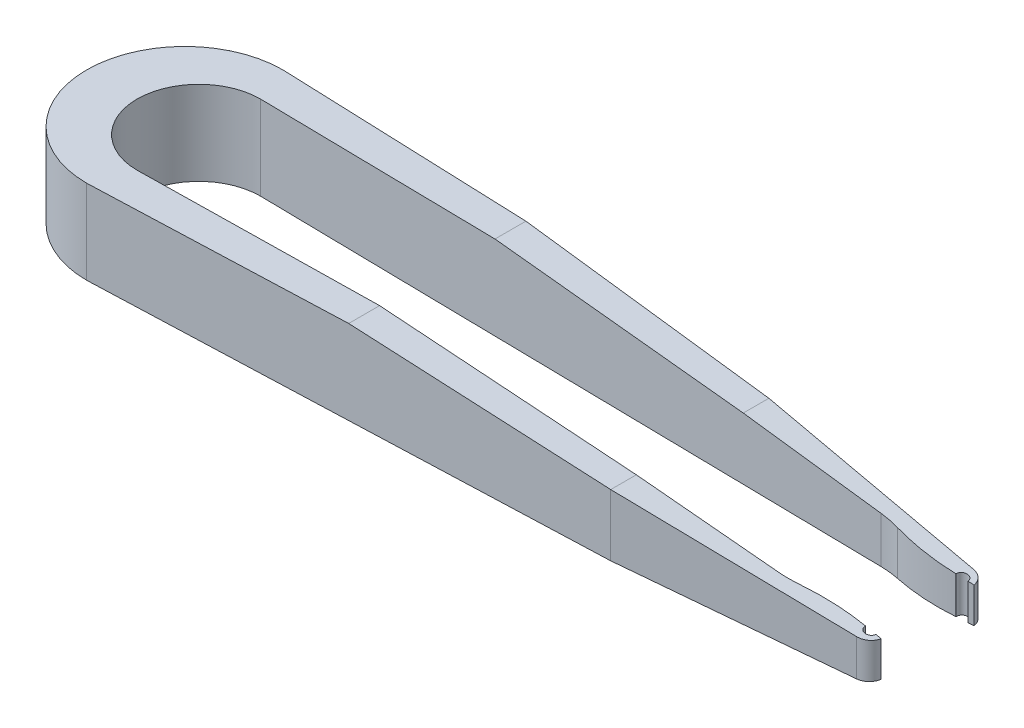
ISO-10303-21;
HEADER;
FILE_DESCRIPTION(('STEP AP214'),'2;1');
FILE_NAME('part.step','',(''),(''),'','','');
FILE_SCHEMA(('AUTOMOTIVE_DESIGN { 1 0 10303 214 1 1 1 1 }'));
ENDSEC;
DATA;
#1=APPLICATION_CONTEXT('core data for automotive mechanical design processes');
#2=APPLICATION_PROTOCOL_DEFINITION('international standard','automotive_design',2000,#1);
#3=PRODUCT_CONTEXT('',#1,'mechanical');
#4=PRODUCT('Part','Part','',(#3));
#5=PRODUCT_RELATED_PRODUCT_CATEGORY('part','',(#4));
#6=PRODUCT_DEFINITION_FORMATION('','',#4);
#7=PRODUCT_DEFINITION_CONTEXT('part definition',#1,'design');
#8=PRODUCT_DEFINITION('design','',#6,#7);
#9=PRODUCT_DEFINITION_SHAPE('','',#8);
#10=(LENGTH_UNIT() NAMED_UNIT(*) SI_UNIT(.MILLI.,.METRE.));
#11=(NAMED_UNIT(*) PLANE_ANGLE_UNIT() SI_UNIT($,.RADIAN.));
#12=(NAMED_UNIT(*) SI_UNIT($,.STERADIAN.) SOLID_ANGLE_UNIT());
#13=UNCERTAINTY_MEASURE_WITH_UNIT(LENGTH_MEASURE(1.E-05),#10,'distance_accuracy_value','');
#14=(GEOMETRIC_REPRESENTATION_CONTEXT(3) GLOBAL_UNCERTAINTY_ASSIGNED_CONTEXT((#13)) GLOBAL_UNIT_ASSIGNED_CONTEXT((#10,
#11,#12)) REPRESENTATION_CONTEXT('',''));
#15=CARTESIAN_POINT('',(0.,0.,0.));
#16=DIRECTION('',(0.,0.,1.));
#17=DIRECTION('',(1.,0.,0.));
#18=AXIS2_PLACEMENT_3D('',#15,#16,#17);
#19=CARTESIAN_POINT('',(32.8354405717214,0.,3.81));
#20=DIRECTION('',(0.0759013080870932,0.,-0.997115335069453));
#21=DIRECTION('',(-0.997115335069453,0.,-0.0759013080870932));
#22=AXIS2_PLACEMENT_3D('',#19,#20,#21);
#23=PLANE('',#22);
#24=DIRECTION('',(-0.997115335069453,0.,-0.0759013080870932));
#25=VECTOR('',#24,1.);
#26=CARTESIAN_POINT('',(32.8354405717214,0.,3.81));
#27=LINE('',#26,#25);
#28=CARTESIAN_POINT('',(36.5641527941834,0.,4.09383289797211));
#29=VERTEX_POINT('',#28);
#30=CARTESIAN_POINT('',(36.5332647207182,0.,4.09148167028777));
#31=VERTEX_POINT('',#30);
#32=EDGE_CURVE('E359',#29,#31,#27,.T.);
#33=ORIENTED_EDGE('',*,*,#32,.T.);
#34=DIRECTION('',(0.,1.,0.));
#35=VECTOR('',#34,1.);
#36=CARTESIAN_POINT('',(36.5332647207182,3.77956014151456,4.09148167028777));
#37=LINE('',#36,#35);
#38=CARTESIAN_POINT('',(36.5332647207182,3.36753841599143,4.09148167028777));
#39=VERTEX_POINT('',#38);
#40=EDGE_CURVE('E319',#31,#39,#37,.T.);
#41=ORIENTED_EDGE('',*,*,#40,.T.);
#42=DIRECTION('',(-0.991017776971419,0.110421923282272,-0.075437156529595));
#43=VECTOR('',#42,1.);
#44=CARTESIAN_POINT('',(33.2490381741618,3.73347596039525,3.84148341815917));
#45=LINE('',#44,#43);
#46=CARTESIAN_POINT('',(36.5641527941834,3.36409678198872,4.09383289797211));
#47=VERTEX_POINT('',#46);
#48=EDGE_CURVE('E439',#47,#39,#45,.T.);
#49=ORIENTED_EDGE('',*,*,#48,.F.);
#50=DIRECTION('',(0.,1.,0.));
#51=VECTOR('',#50,1.);
#52=CARTESIAN_POINT('',(36.5641527941834,0.,4.09383289797211));
#53=LINE('',#52,#51);
#54=EDGE_CURVE('E312',#47,#29,#53,.F.);
#55=ORIENTED_EDGE('',*,*,#54,.T.);
#56=EDGE_LOOP('',(#33,#41,#49,#55));
#57=FACE_BOUND('',#56,.T.);
#58=ADVANCED_FACE('F38',(#57),#23,.T.);
#59=DIRECTION('',(-0.991017776971419,0.110421923282272,-0.075437156529595));
#60=VECTOR('',#59,1.);
#61=CARTESIAN_POINT('',(33.2490381741618,3.73347596039525,3.84148341815917));
#62=LINE('',#61,#60);
#63=CARTESIAN_POINT('',(38.0866873843987,3.19445179516604,4.20972958809481));
#64=VERTEX_POINT('',#63);
#65=CARTESIAN_POINT('',(37.577221974614,3.25121783075235,4.1709486269886));
#66=VERTEX_POINT('',#65);
#67=EDGE_CURVE('E390',#64,#66,#62,.T.);
#68=ORIENTED_EDGE('',*,*,#67,.F.);
#69=DIRECTION('',(0.,1.,0.));
#70=VECTOR('',#69,1.);
#71=CARTESIAN_POINT('',(38.0866873843987,0.,4.20972958809486));
#72=LINE('',#71,#70);
#73=CARTESIAN_POINT('',(38.0866873843987,0.,4.20972958809486));
#74=VERTEX_POINT('',#73);
#75=EDGE_CURVE('E362',#74,#64,#72,.T.);
#76=ORIENTED_EDGE('',*,*,#75,.F.);
#77=CARTESIAN_POINT('',(37.577221974614,0.,4.1709486269886));
#78=VERTEX_POINT('',#77);
#79=EDGE_CURVE('E360',#74,#78,#27,.T.);
#80=ORIENTED_EDGE('',*,*,#79,.T.);
#81=DIRECTION('',(0.,1.,0.));
#82=VECTOR('',#81,1.);
#83=CARTESIAN_POINT('',(37.577221974614,0.,4.1709486269886));
#84=LINE('',#83,#82);
#85=EDGE_CURVE('E309',#78,#66,#84,.T.);
#86=ORIENTED_EDGE('',*,*,#85,.T.);
#87=EDGE_LOOP('',(#68,#76,#80,#86));
#88=FACE_BOUND('',#87,.T.);
#89=ADVANCED_FACE('F473',(#88),#23,.T.);
#90=CARTESIAN_POINT('',(32.8354405717214,0.,-3.81));
#91=DIRECTION('',(-0.0759013080870932,0.,-0.997115335069453));
#92=DIRECTION('',(-0.997115335069453,0.,0.0759013080870932));
#93=AXIS2_PLACEMENT_3D('',#90,#91,#92);
#94=PLANE('',#93);
#95=DIRECTION('',(-0.991017776971419,0.110421923282272,0.075437156529595));
#96=VECTOR('',#95,1.);
#97=CARTESIAN_POINT('',(33.2490381741618,3.73347596039525,-3.84148341815917));
#98=LINE('',#97,#96);
#99=CARTESIAN_POINT('',(36.5641527941834,3.36409678198872,-4.09383289797211));
#100=VERTEX_POINT('',#99);
#101=CARTESIAN_POINT('',(36.5332647207182,3.36753841599143,-4.09148167028777));
#102=VERTEX_POINT('',#101);
#103=EDGE_CURVE('E341',#100,#102,#98,.T.);
#104=ORIENTED_EDGE('',*,*,#103,.T.);
#105=DIRECTION('',(0.,-1.,0.));
#106=VECTOR('',#105,1.);
#107=CARTESIAN_POINT('',(36.5332647207182,0.,-4.09148167028777));
#108=LINE('',#107,#106);
#109=CARTESIAN_POINT('',(36.5332647207182,0.,-4.09148167028777));
#110=VERTEX_POINT('',#109);
#111=EDGE_CURVE('E11',#102,#110,#108,.T.);
#112=ORIENTED_EDGE('',*,*,#111,.T.);
#113=DIRECTION('',(-0.997115335069453,0.,0.0759013080870932));
#114=VECTOR('',#113,1.);
#115=CARTESIAN_POINT('',(32.8354405717214,0.,-3.81));
#116=LINE('',#115,#114);
#117=CARTESIAN_POINT('',(36.5641527941834,0.,-4.09383289797211));
#118=VERTEX_POINT('',#117);
#119=EDGE_CURVE('E224',#118,#110,#116,.T.);
#120=ORIENTED_EDGE('',*,*,#119,.F.);
#121=DIRECTION('',(0.,1.,0.));
#122=VECTOR('',#121,1.);
#123=CARTESIAN_POINT('',(36.5641527941834,0.,-4.09383289797211));
#124=LINE('',#123,#122);
#125=EDGE_CURVE('E306',#118,#100,#124,.T.);
#126=ORIENTED_EDGE('',*,*,#125,.T.);
#127=EDGE_LOOP('',(#104,#112,#120,#126));
#128=FACE_BOUND('',#127,.T.);
#129=ADVANCED_FACE('F373',(#128),#94,.F.);
#130=CARTESIAN_POINT('',(0.,7.62,0.));
#131=DIRECTION('',(0.,-1.,0.));
#132=DIRECTION('',(0.,0.,-1.));
#133=AXIS2_PLACEMENT_3D('',#130,#131,#132);
#134=PLANE('',#133);
#135=DIRECTION('',(0.999288762356679,0.,-0.037709009900252));
#136=VECTOR('',#135,1.);
#137=CARTESIAN_POINT('',(-29.21,7.62,8.89));
#138=LINE('',#137,#136);
#139=CARTESIAN_POINT('',(-29.21,7.62,8.89));
#140=VERTEX_POINT('',#139);
#141=CARTESIAN_POINT('',(-6.3333197793544,7.62,8.02672904827752));
#142=VERTEX_POINT('',#141);
#143=EDGE_CURVE('E236',#140,#142,#138,.T.);
#144=ORIENTED_EDGE('',*,*,#143,.T.);
#145=DIRECTION('',(0.,0.,1.));
#146=VECTOR('',#145,1.);
#147=CARTESIAN_POINT('',(-6.3333197793544,7.62,-8.89));
#148=LINE('',#147,#146);
#149=CARTESIAN_POINT('',(-6.3333197793544,7.62,5.22679509720263));
#150=VERTEX_POINT('',#149);
#151=EDGE_CURVE('E411',#150,#142,#148,.T.);
#152=ORIENTED_EDGE('',*,*,#151,.F.);
#153=DIRECTION('',(-0.999860295571869,0.,0.016714943581564));
#154=VECTOR('',#153,1.);
#155=CARTESIAN_POINT('',(0.085583917776607,7.62,5.1194884928418));
#156=LINE('',#155,#154);
#157=CARTESIAN_POINT('',(-27.94,7.62,5.588));
#158=VERTEX_POINT('',#157);
#159=EDGE_CURVE('E261',#150,#158,#156,.T.);
#160=ORIENTED_EDGE('',*,*,#159,.T.);
#161=CARTESIAN_POINT('',(-27.94,7.62,0.));
#162=DIRECTION('',(0.,1.,0.));
#163=DIRECTION('',(0.,0.,1.));
#164=AXIS2_PLACEMENT_3D('',#161,#162,#163);
#165=CIRCLE('',#164,5.588);
#166=CARTESIAN_POINT('',(-27.94,7.62,-5.588));
#167=VERTEX_POINT('',#166);
#168=EDGE_CURVE('E246',#167,#158,#165,.T.);
#169=ORIENTED_EDGE('',*,*,#168,.F.);
#170=DIRECTION('',(0.999860295571869,0.,0.016714943581564));
#171=VECTOR('',#170,1.);
#172=CARTESIAN_POINT('',(0.085583917776607,7.62,-5.1194884928418));
#173=LINE('',#172,#171);
#174=CARTESIAN_POINT('',(-6.3333197793544,7.62,-5.22679509720263));
#175=VERTEX_POINT('',#174);
#176=EDGE_CURVE('E253',#167,#175,#173,.T.);
#177=ORIENTED_EDGE('',*,*,#176,.T.);
#178=CARTESIAN_POINT('',(-6.3333197793544,7.62,-8.02672904827752));
#179=VERTEX_POINT('',#178);
#180=EDGE_CURVE('E401',#179,#175,#148,.T.);
#181=ORIENTED_EDGE('',*,*,#180,.F.);
#182=DIRECTION('',(0.999288762356679,0.,0.037709009900252));
#183=VECTOR('',#182,1.);
#184=CARTESIAN_POINT('',(-29.21,7.62,-8.89));
#185=LINE('',#184,#183);
#186=CARTESIAN_POINT('',(-29.21,7.62,-8.89));
#187=VERTEX_POINT('',#186);
#188=EDGE_CURVE('E240',#187,#179,#185,.T.);
#189=ORIENTED_EDGE('',*,*,#188,.F.);
#190=CARTESIAN_POINT('',(-29.21,7.62,0.));
#191=DIRECTION('',(0.,-1.,0.));
#192=DIRECTION('',(0.,0.,-1.));
#193=AXIS2_PLACEMENT_3D('',#190,#191,#192);
#194=CIRCLE('',#193,8.89);
#195=CARTESIAN_POINT('',(-38.1,7.62,0.));
#196=VERTEX_POINT('',#195);
#197=EDGE_CURVE('E280',#187,#196,#194,.F.);
#198=ORIENTED_EDGE('',*,*,#197,.T.);
#199=CARTESIAN_POINT('',(-29.21,7.62,0.));
#200=DIRECTION('',(0.,-1.,0.));
#201=DIRECTION('',(0.,0.,-1.));
#202=AXIS2_PLACEMENT_3D('',#199,#200,#201);
#203=CIRCLE('',#202,8.89);
#204=EDGE_CURVE('E277',#196,#140,#203,.F.);
#205=ORIENTED_EDGE('',*,*,#204,.T.);
#206=EDGE_LOOP('',(#144,#152,#160,#169,#177,#181,#189,#198,#205));
#207=FACE_BOUND('',#206,.T.);
#208=ADVANCED_FACE('F399',(#207),#134,.F.);
#209=CARTESIAN_POINT('',(0.,0.,0.));
#210=DIRECTION('',(0.,-1.,0.));
#211=DIRECTION('',(0.,0.,-1.));
#212=AXIS2_PLACEMENT_3D('',#209,#210,#211);
#213=PLANE('',#212);
#214=CARTESIAN_POINT('',(29.0992515650635,0.,-4.25678323165612));
#215=DIRECTION('',(0.,-1.,0.));
#216=DIRECTION('',(0.,0.,-1.));
#217=AXIS2_PLACEMENT_3D('',#214,#215,#216);
#218=CIRCLE('',#217,8.89);
#219=CARTESIAN_POINT('',(29.2478474135036,0.,4.63197479597779));
#220=VERTEX_POINT('',#219);
#221=CARTESIAN_POINT('',(30.8923772184232,0.,4.45050109764328));
#222=VERTEX_POINT('',#221);
#223=EDGE_CURVE('E291',#220,#222,#218,.F.);
#224=ORIENTED_EDGE('',*,*,#223,.T.);
#225=CARTESIAN_POINT('',(34.9909501403885,0.,24.3528652788991));
#226=DIRECTION('',(0.,-1.,0.));
#227=DIRECTION('',(0.,0.,-1.));
#228=AXIS2_PLACEMENT_3D('',#225,#226,#227);
#229=CIRCLE('',#228,20.32);
#230=EDGE_CURVE('E328',#222,#31,#229,.T.);
#231=ORIENTED_EDGE('',*,*,#230,.T.);
#232=ORIENTED_EDGE('',*,*,#32,.F.);
#233=CARTESIAN_POINT('',(37.0706873843987,0.,4.13239076248036));
#234=DIRECTION('',(0.,-1.,0.));
#235=DIRECTION('',(0.,0.,-1.));
#236=AXIS2_PLACEMENT_3D('',#233,#234,#235);
#237=CIRCLE('',#236,0.508000000000002);
#238=EDGE_CURVE('E353',#78,#29,#237,.T.);
#239=ORIENTED_EDGE('',*,*,#238,.F.);
#240=ORIENTED_EDGE('',*,*,#79,.F.);
#241=CARTESIAN_POINT('',(36.83,0.,4.02632615875612));
#242=DIRECTION('',(0.,-1.,0.));
#243=DIRECTION('',(0.,0.,-1.));
#244=AXIS2_PLACEMENT_3D('',#241,#242,#243);
#245=CIRCLE('',#244,1.27);
#246=CARTESIAN_POINT('',(36.9460657696457,0.,5.29101139118218));
#247=VERTEX_POINT('',#246);
#248=EDGE_CURVE('E301',#74,#247,#245,.T.);
#249=ORIENTED_EDGE('',*,*,#248,.T.);
#250=DIRECTION('',(0.995815143642565,0.,-0.091390369799764));
#251=VECTOR('',#250,1.);
#252=CARTESIAN_POINT('',(16.5433604412912,0.,7.16345809655505));
#253=LINE('',#252,#251);
#254=CARTESIAN_POINT('',(16.5433604412912,0.,7.16345809655505));
#255=VERTEX_POINT('',#254);
#256=EDGE_CURVE('E219',#255,#247,#253,.T.);
#257=ORIENTED_EDGE('',*,*,#256,.F.);
#258=DIRECTION('',(0.999288762356679,0.,-0.037709009900252));
#259=VECTOR('',#258,1.);
#260=CARTESIAN_POINT('',(-29.21,0.,8.89));
#261=LINE('',#260,#259);
#262=CARTESIAN_POINT('',(-29.21,0.,8.89));
#263=VERTEX_POINT('',#262);
#264=EDGE_CURVE('E237',#263,#255,#261,.T.);
#265=ORIENTED_EDGE('',*,*,#264,.F.);
#266=CARTESIAN_POINT('',(-29.21,0.,0.));
#267=DIRECTION('',(0.,-1.,0.));
#268=DIRECTION('',(0.,0.,-1.));
#269=AXIS2_PLACEMENT_3D('',#266,#267,#268);
#270=CIRCLE('',#269,8.89);
#271=CARTESIAN_POINT('',(-38.1,0.,0.));
#272=VERTEX_POINT('',#271);
#273=EDGE_CURVE('E270',#263,#272,#270,.T.);
#274=ORIENTED_EDGE('',*,*,#273,.T.);
#275=CARTESIAN_POINT('',(-29.21,0.,0.));
#276=DIRECTION('',(0.,-1.,0.));
#277=DIRECTION('',(0.,0.,-1.));
#278=AXIS2_PLACEMENT_3D('',#275,#276,#277);
#279=CIRCLE('',#278,8.89);
#280=CARTESIAN_POINT('',(-29.21,0.,-8.89));
#281=VERTEX_POINT('',#280);
#282=EDGE_CURVE('E272',#272,#281,#279,.T.);
#283=ORIENTED_EDGE('',*,*,#282,.T.);
#284=DIRECTION('',(0.999288762356679,0.,0.037709009900252));
#285=VECTOR('',#284,1.);
#286=CARTESIAN_POINT('',(-29.21,0.,-8.89));
#287=LINE('',#286,#285);
#288=CARTESIAN_POINT('',(16.5433604412912,0.,-7.16345809655505));
#289=VERTEX_POINT('',#288);
#290=EDGE_CURVE('E243',#281,#289,#287,.T.);
#291=ORIENTED_EDGE('',*,*,#290,.T.);
#292=DIRECTION('',(0.995815143642565,0.,0.091390369799764));
#293=VECTOR('',#292,1.);
#294=CARTESIAN_POINT('',(16.5433604412912,0.,-7.16345809655505));
#295=LINE('',#294,#293);
#296=CARTESIAN_POINT('',(36.9460657696457,0.,-5.29101139118218));
#297=VERTEX_POINT('',#296);
#298=EDGE_CURVE('E230',#289,#297,#295,.T.);
#299=ORIENTED_EDGE('',*,*,#298,.T.);
#300=CARTESIAN_POINT('',(36.83,0.,-4.02632615875612));
#301=DIRECTION('',(0.,-1.,0.));
#302=DIRECTION('',(0.,0.,-1.));
#303=AXIS2_PLACEMENT_3D('',#300,#301,#302);
#304=CIRCLE('',#303,1.27);
#305=CARTESIAN_POINT('',(38.0866873843987,0.,-4.20972958809486));
#306=VERTEX_POINT('',#305);
#307=EDGE_CURVE('E299',#297,#306,#304,.T.);
#308=ORIENTED_EDGE('',*,*,#307,.T.);
#309=CARTESIAN_POINT('',(37.577221974614,0.,-4.1709486269886));
#310=VERTEX_POINT('',#309);
#311=EDGE_CURVE('E218',#306,#310,#116,.T.);
#312=ORIENTED_EDGE('',*,*,#311,.T.);
#313=CARTESIAN_POINT('',(37.0706873843987,0.,-4.13239076248036));
#314=DIRECTION('',(0.,1.,0.));
#315=DIRECTION('',(0.,0.,1.));
#316=AXIS2_PLACEMENT_3D('',#313,#314,#315);
#317=CIRCLE('',#316,0.508000000000002);
#318=EDGE_CURVE('E356',#310,#118,#317,.T.);
#319=ORIENTED_EDGE('',*,*,#318,.T.);
#320=ORIENTED_EDGE('',*,*,#119,.T.);
#321=CARTESIAN_POINT('',(34.9909501403885,0.,-24.3528652788991));
#322=DIRECTION('',(0.,-1.,0.));
#323=DIRECTION('',(0.,0.,-1.));
#324=AXIS2_PLACEMENT_3D('',#321,#322,#323);
#325=CIRCLE('',#324,20.32);
#326=CARTESIAN_POINT('',(30.8923772184232,0.,-4.45050109764328));
#327=VERTEX_POINT('',#326);
#328=EDGE_CURVE('E326',#110,#327,#325,.T.);
#329=ORIENTED_EDGE('',*,*,#328,.T.);
#330=CARTESIAN_POINT('',(29.0992515650635,0.,4.25678323165612));
#331=DIRECTION('',(0.,-1.,0.));
#332=DIRECTION('',(0.,0.,-1.));
#333=AXIS2_PLACEMENT_3D('',#330,#331,#332);
#334=CIRCLE('',#333,8.89);
#335=CARTESIAN_POINT('',(29.2478474135036,0.,-4.63197479597779));
#336=VERTEX_POINT('',#335);
#337=EDGE_CURVE('E294',#327,#336,#334,.F.);
#338=ORIENTED_EDGE('',*,*,#337,.T.);
#339=DIRECTION('',(0.999860295571869,0.,0.016714943581564));
#340=VECTOR('',#339,1.);
#341=CARTESIAN_POINT('',(0.085583917776607,0.,-5.1194884928418));
#342=LINE('',#341,#340);
#343=CARTESIAN_POINT('',(-27.94,0.,-5.588));
#344=VERTEX_POINT('',#343);
#345=EDGE_CURVE('E255',#344,#336,#342,.T.);
#346=ORIENTED_EDGE('',*,*,#345,.F.);
#347=CARTESIAN_POINT('',(-27.94,0.,0.));
#348=DIRECTION('',(0.,1.,0.));
#349=DIRECTION('',(0.,0.,1.));
#350=AXIS2_PLACEMENT_3D('',#347,#348,#349);
#351=CIRCLE('',#350,5.588);
#352=CARTESIAN_POINT('',(-27.94,0.,5.588));
#353=VERTEX_POINT('',#352);
#354=EDGE_CURVE('E249',#344,#353,#351,.T.);
#355=ORIENTED_EDGE('',*,*,#354,.T.);
#356=DIRECTION('',(-0.999860295571869,0.,0.016714943581564));
#357=VECTOR('',#356,1.);
#358=CARTESIAN_POINT('',(0.085583917776607,0.,5.1194884928418));
#359=LINE('',#358,#357);
#360=EDGE_CURVE('E252',#220,#353,#359,.T.);
#361=ORIENTED_EDGE('',*,*,#360,.F.);
#362=EDGE_LOOP('',(#224,#231,#232,#239,#240,#249,#257,#265,#274,#283,#291,#299,#308,#312,#319,
#320,#329,#338,#346,#355,#361));
#363=FACE_BOUND('',#362,.T.);
#364=ADVANCED_FACE('F370',(#363),#213,.T.);
#365=CARTESIAN_POINT('',(36.83,0.,4.02632615875612));
#366=DIRECTION('',(0.,-1.,0.));
#367=DIRECTION('',(0.,0.,-1.));
#368=AXIS2_PLACEMENT_3D('',#365,#366,#367);
#369=CYLINDRICAL_SURFACE('',#368,1.27);
#370=CARTESIAN_POINT('',(36.83,3.3344753559683,4.02632615875612));
#371=DIRECTION('',(-0.11073746325577,-0.993849693983792,0.));
#372=DIRECTION('',(0.993849693983792,-0.11073746325577,0.));
#373=AXIS2_PLACEMENT_3D('',#370,#371,#372);
#374=ELLIPSE('',#373,1.27785922528111,1.27);
#375=CARTESIAN_POINT('',(36.9460657696457,3.32154298905286,5.29101139118218));
#376=VERTEX_POINT('',#375);
#377=EDGE_CURVE('E378',#376,#64,#374,.F.);
#378=ORIENTED_EDGE('',*,*,#377,.F.);
#379=DIRECTION('',(0.,1.,0.));
#380=VECTOR('',#379,1.);
#381=CARTESIAN_POINT('',(36.9460657696457,7.62,5.29101139118218));
#382=LINE('',#381,#380);
#383=EDGE_CURVE('E296',#247,#376,#382,.T.);
#384=ORIENTED_EDGE('',*,*,#383,.F.);
#385=ORIENTED_EDGE('',*,*,#248,.F.);
#386=ORIENTED_EDGE('',*,*,#75,.T.);
#387=EDGE_LOOP('',(#378,#384,#385,#386));
#388=FACE_BOUND('',#387,.T.);
#389=ADVANCED_FACE('F432',(#388),#369,.T.);
#390=CARTESIAN_POINT('',(-29.21,0.,8.89));
#391=DIRECTION('',(0.037709009900252,0.,0.999288762356679));
#392=DIRECTION('',(0.999288762356679,0.,-0.037709009900252));
#393=AXIS2_PLACEMENT_3D('',#390,#391,#392);
#394=PLANE('',#393);
#395=DIRECTION('',(0.995401680306779,-0.0881167770110264,-0.0375623275587464));
#396=VECTOR('',#395,1.);
#397=CARTESIAN_POINT('',(-28.3640101978275,9.57024126783196,8.85807585652179));
#398=LINE('',#397,#396);
#399=CARTESIAN_POINT('',(16.5433604412912,5.59486846804004,7.16345809655504));
#400=VERTEX_POINT('',#399);
#401=EDGE_CURVE('E351',#142,#400,#398,.T.);
#402=ORIENTED_EDGE('',*,*,#401,.F.);
#403=ORIENTED_EDGE('',*,*,#143,.F.);
#404=DIRECTION('',(0.,-1.,0.));
#405=VECTOR('',#404,1.);
#406=CARTESIAN_POINT('',(-29.21,7.62,8.89));
#407=LINE('',#406,#405);
#408=EDGE_CURVE('E282',#140,#263,#407,.T.);
#409=ORIENTED_EDGE('',*,*,#408,.T.);
#410=ORIENTED_EDGE('',*,*,#264,.T.);
#411=DIRECTION('',(0.,1.,0.));
#412=VECTOR('',#411,1.);
#413=CARTESIAN_POINT('',(16.5433604412912,0.,7.16345809655505));
#414=LINE('',#413,#412);
#415=EDGE_CURVE('E222',#255,#400,#414,.T.);
#416=ORIENTED_EDGE('',*,*,#415,.T.);
#417=EDGE_LOOP('',(#402,#403,#409,#410,#416));
#418=FACE_BOUND('',#417,.T.);
#419=ADVANCED_FACE('F415',(#418),#394,.T.);
#420=CARTESIAN_POINT('',(-29.21,7.62,0.));
#421=DIRECTION('',(0.,-1.,0.));
#422=DIRECTION('',(0.,0.,-1.));
#423=AXIS2_PLACEMENT_3D('',#420,#421,#422);
#424=CYLINDRICAL_SURFACE('',#423,8.89);
#425=ORIENTED_EDGE('',*,*,#408,.F.);
#426=ORIENTED_EDGE('',*,*,#204,.F.);
#427=DIRECTION('',(0.,-1.,0.));
#428=VECTOR('',#427,1.);
#429=CARTESIAN_POINT('',(-38.1,7.62,0.));
#430=LINE('',#429,#428);
#431=EDGE_CURVE('E267',#272,#196,#430,.F.);
#432=ORIENTED_EDGE('',*,*,#431,.F.);
#433=ORIENTED_EDGE('',*,*,#273,.F.);
#434=EDGE_LOOP('',(#425,#426,#432,#433));
#435=FACE_BOUND('',#434,.T.);
#436=ADVANCED_FACE('F409',(#435),#424,.T.);
#437=CARTESIAN_POINT('',(-29.21,7.62,0.));
#438=DIRECTION('',(0.,-1.,0.));
#439=DIRECTION('',(0.,0.,-1.));
#440=AXIS2_PLACEMENT_3D('',#437,#438,#439);
#441=CYLINDRICAL_SURFACE('',#440,8.89);
#442=ORIENTED_EDGE('',*,*,#197,.F.);
#443=DIRECTION('',(0.,-1.,0.));
#444=VECTOR('',#443,1.);
#445=CARTESIAN_POINT('',(-29.21,7.62,-8.89));
#446=LINE('',#445,#444);
#447=EDGE_CURVE('E275',#281,#187,#446,.F.);
#448=ORIENTED_EDGE('',*,*,#447,.F.);
#449=ORIENTED_EDGE('',*,*,#282,.F.);
#450=ORIENTED_EDGE('',*,*,#431,.T.);
#451=EDGE_LOOP('',(#442,#448,#449,#450));
#452=FACE_BOUND('',#451,.T.);
#453=ADVANCED_FACE('F403',(#452),#441,.T.);
#454=CARTESIAN_POINT('',(-27.94,0.,0.));
#455=DIRECTION('',(0.,1.,0.));
#456=DIRECTION('',(0.,0.,1.));
#457=AXIS2_PLACEMENT_3D('',#454,#455,#456);
#458=CYLINDRICAL_SURFACE('',#457,5.588);
#459=ORIENTED_EDGE('',*,*,#168,.T.);
#460=DIRECTION('',(0.,1.,0.));
#461=VECTOR('',#460,1.);
#462=CARTESIAN_POINT('',(-27.94,0.,5.588));
#463=LINE('',#462,#461);
#464=EDGE_CURVE('E258',#353,#158,#463,.T.);
#465=ORIENTED_EDGE('',*,*,#464,.F.);
#466=ORIENTED_EDGE('',*,*,#354,.F.);
#467=DIRECTION('',(0.,1.,0.));
#468=VECTOR('',#467,1.);
#469=CARTESIAN_POINT('',(-27.94,0.,-5.588));
#470=LINE('',#469,#468);
#471=EDGE_CURVE('E265',#344,#167,#470,.T.);
#472=ORIENTED_EDGE('',*,*,#471,.T.);
#473=EDGE_LOOP('',(#459,#465,#466,#472));
#474=FACE_BOUND('',#473,.T.);
#475=ADVANCED_FACE('F448',(#474),#458,.F.);
#476=CARTESIAN_POINT('',(0.085583917776607,0.,-5.1194884928418));
#477=DIRECTION('',(-0.016714943581564,0.,0.999860295571869));
#478=DIRECTION('',(0.999860295571869,0.,0.016714943581564));
#479=AXIS2_PLACEMENT_3D('',#476,#477,#478);
#480=PLANE('',#479);
#481=DIRECTION('',(0.99371255105722,-0.110722182414126,0.0166121700209263));
#482=VECTOR('',#481,1.);
#483=CARTESIAN_POINT('',(0.902927533998079,7.33756847072672,-5.10582473152194));
#484=LINE('',#483,#482);
#485=CARTESIAN_POINT('',(16.5433604412912,5.59486846804004,-4.84435924999973));
#486=VERTEX_POINT('',#485);
#487=CARTESIAN_POINT('',(29.2478474135036,4.17929962721317,-4.63197479597779));
#488=VERTEX_POINT('',#487);
#489=EDGE_CURVE('E340',#486,#488,#484,.T.);
#490=ORIENTED_EDGE('',*,*,#489,.F.);
#491=DIRECTION('',(0.995966566135088,-0.088166782872534,0.0166498510199873));
#492=VECTOR('',#491,1.);
#493=CARTESIAN_POINT('',(0.704808429915411,6.99695787915477,-5.1091367438719));
#494=LINE('',#493,#492);
#495=EDGE_CURVE('E349',#175,#486,#494,.T.);
#496=ORIENTED_EDGE('',*,*,#495,.F.);
#497=ORIENTED_EDGE('',*,*,#176,.F.);
#498=ORIENTED_EDGE('',*,*,#471,.F.);
#499=ORIENTED_EDGE('',*,*,#345,.T.);
#500=DIRECTION('',(0.,1.,0.));
#501=VECTOR('',#500,1.);
#502=CARTESIAN_POINT('',(29.2478474135036,7.62,-4.63197479597779));
#503=LINE('',#502,#501);
#504=EDGE_CURVE('E288',#336,#488,#503,.T.);
#505=ORIENTED_EDGE('',*,*,#504,.T.);
#506=EDGE_LOOP('',(#490,#496,#497,#498,#499,#505));
#507=FACE_BOUND('',#506,.T.);
#508=ADVANCED_FACE('F444',(#507),#480,.T.);
#509=CARTESIAN_POINT('',(0.085583917776607,0.,5.1194884928418));
#510=DIRECTION('',(-0.016714943581564,0.,-0.999860295571869));
#511=DIRECTION('',(-0.999860295571869,0.,0.016714943581564));
#512=AXIS2_PLACEMENT_3D('',#509,#510,#511);
#513=PLANE('',#512);
#514=DIRECTION('',(-0.99371255105722,0.110722182414126,0.0166121700209263));
#515=VECTOR('',#514,1.);
#516=CARTESIAN_POINT('',(0.902927533998079,7.33756847072672,5.10582473152194));
#517=LINE('',#516,#515);
#518=CARTESIAN_POINT('',(29.2478474135036,4.17929962721316,4.63197479597779));
#519=VERTEX_POINT('',#518);
#520=CARTESIAN_POINT('',(16.5433604412912,5.59486846804004,4.84435924999973));
#521=VERTEX_POINT('',#520);
#522=EDGE_CURVE('E427',#519,#521,#517,.T.);
#523=ORIENTED_EDGE('',*,*,#522,.F.);
#524=DIRECTION('',(0.,1.,0.));
#525=VECTOR('',#524,1.);
#526=CARTESIAN_POINT('',(29.2478474135036,0.,4.63197479597779));
#527=LINE('',#526,#525);
#528=EDGE_CURVE('E284',#519,#220,#527,.F.);
#529=ORIENTED_EDGE('',*,*,#528,.T.);
#530=ORIENTED_EDGE('',*,*,#360,.T.);
#531=ORIENTED_EDGE('',*,*,#464,.T.);
#532=ORIENTED_EDGE('',*,*,#159,.F.);
#533=DIRECTION('',(-0.995966566135088,0.088166782872534,0.0166498510199873));
#534=VECTOR('',#533,1.);
#535=CARTESIAN_POINT('',(0.704808429915411,6.99695787915477,5.1091367438719));
#536=LINE('',#535,#534);
#537=EDGE_CURVE('E343',#521,#150,#536,.T.);
#538=ORIENTED_EDGE('',*,*,#537,.F.);
#539=EDGE_LOOP('',(#523,#529,#530,#531,#532,#538));
#540=FACE_BOUND('',#539,.T.);
#541=ADVANCED_FACE('F474',(#540),#513,.T.);
#542=CARTESIAN_POINT('',(-29.21,0.,-8.89));
#543=DIRECTION('',(-0.037709009900252,0.,0.999288762356679));
#544=DIRECTION('',(0.999288762356679,0.,0.037709009900252));
#545=AXIS2_PLACEMENT_3D('',#542,#543,#544);
#546=PLANE('',#545);
#547=ORIENTED_EDGE('',*,*,#188,.T.);
#548=DIRECTION('',(0.995401680306779,-0.0881167770110264,0.0375623275587464));
#549=VECTOR('',#548,1.);
#550=CARTESIAN_POINT('',(-28.3640101978275,9.57024126783196,-8.85807585652179));
#551=LINE('',#550,#549);
#552=CARTESIAN_POINT('',(16.5433604412912,5.59486846804004,-7.16345809655505));
#553=VERTEX_POINT('',#552);
#554=EDGE_CURVE('E316',#179,#553,#551,.T.);
#555=ORIENTED_EDGE('',*,*,#554,.T.);
#556=DIRECTION('',(0.,1.,0.));
#557=VECTOR('',#556,1.);
#558=CARTESIAN_POINT('',(16.5433604412912,0.,-7.16345809655505));
#559=LINE('',#558,#557);
#560=EDGE_CURVE('E233',#289,#553,#559,.T.);
#561=ORIENTED_EDGE('',*,*,#560,.F.);
#562=ORIENTED_EDGE('',*,*,#290,.F.);
#563=ORIENTED_EDGE('',*,*,#447,.T.);
#564=EDGE_LOOP('',(#547,#555,#561,#562,#563));
#565=FACE_BOUND('',#564,.T.);
#566=ADVANCED_FACE('F394',(#565),#546,.F.);
#567=CARTESIAN_POINT('',(16.5433604412912,0.,-7.16345809655505));
#568=DIRECTION('',(-0.091390369799764,0.,0.995815143642565));
#569=DIRECTION('',(0.995815143642565,0.,0.091390369799764));
#570=AXIS2_PLACEMENT_3D('',#567,#568,#569);
#571=PLANE('',#570);
#572=ORIENTED_EDGE('',*,*,#560,.T.);
#573=DIRECTION('',(0.989741262332934,-0.110279690514349,0.0908329427887862));
#574=VECTOR('',#573,1.);
#575=CARTESIAN_POINT('',(17.1540311595494,5.52682585894749,-7.10741413787075));
#576=LINE('',#575,#574);
#577=CARTESIAN_POINT('',(36.9460657696457,3.32154298905286,-5.29101139118218));
#578=VERTEX_POINT('',#577);
#579=EDGE_CURVE('E214',#553,#578,#576,.T.);
#580=ORIENTED_EDGE('',*,*,#579,.T.);
#581=DIRECTION('',(0.,1.,0.));
#582=VECTOR('',#581,1.);
#583=CARTESIAN_POINT('',(36.9460657696457,0.,-5.29101139118218));
#584=LINE('',#583,#582);
#585=EDGE_CURVE('E213',#578,#297,#584,.F.);
#586=ORIENTED_EDGE('',*,*,#585,.T.);
#587=ORIENTED_EDGE('',*,*,#298,.F.);
#588=EDGE_LOOP('',(#572,#580,#586,#587));
#589=FACE_BOUND('',#588,.T.);
#590=ADVANCED_FACE('F382',(#589),#571,.F.);
#591=CARTESIAN_POINT('',(16.5433604412912,0.,7.16345809655505));
#592=DIRECTION('',(0.091390369799764,0.,0.995815143642565));
#593=DIRECTION('',(0.995815143642565,0.,-0.091390369799764));
#594=AXIS2_PLACEMENT_3D('',#591,#592,#593);
#595=PLANE('',#594);
#596=DIRECTION('',(0.989741262332934,-0.110279690514349,-0.0908329427887862));
#597=VECTOR('',#596,1.);
#598=CARTESIAN_POINT('',(17.1540311595494,5.52682585894749,7.10741413787075));
#599=LINE('',#598,#597);
#600=EDGE_CURVE('E376',#400,#376,#599,.T.);
#601=ORIENTED_EDGE('',*,*,#600,.F.);
#602=ORIENTED_EDGE('',*,*,#415,.F.);
#603=ORIENTED_EDGE('',*,*,#256,.T.);
#604=ORIENTED_EDGE('',*,*,#383,.T.);
#605=EDGE_LOOP('',(#601,#602,#603,#604));
#606=FACE_BOUND('',#605,.T.);
#607=ADVANCED_FACE('F429',(#606),#595,.T.);
#608=CARTESIAN_POINT('',(29.0992515650635,0.,-4.25678323165612));
#609=DIRECTION('',(0.,-1.,0.));
#610=DIRECTION('',(0.,0.,-1.));
#611=AXIS2_PLACEMENT_3D('',#608,#609,#610);
#612=CYLINDRICAL_SURFACE('',#611,8.89);
#613=CARTESIAN_POINT('',(29.0992515650635,4.19585658487608,-4.25678323165612));
#614=DIRECTION('',(-0.11073746325577,-0.993849693983792,0.));
#615=DIRECTION('',(0.993849693983792,-0.11073746325577,0.));
#616=AXIS2_PLACEMENT_3D('',#613,#614,#615);
#617=ELLIPSE('',#616,8.94501457696779,8.89);
#618=CARTESIAN_POINT('',(30.8923772184232,3.99606159841695,4.45050109764328));
#619=VERTEX_POINT('',#618);
#620=EDGE_CURVE('E434',#519,#619,#617,.F.);
#621=ORIENTED_EDGE('',*,*,#620,.T.);
#622=DIRECTION('',(0.,-1.,0.));
#623=VECTOR('',#622,1.);
#624=CARTESIAN_POINT('',(30.8923772184232,0.,4.45050109764328));
#625=LINE('',#624,#623);
#626=EDGE_CURVE('E324',#619,#222,#625,.T.);
#627=ORIENTED_EDGE('',*,*,#626,.T.);
#628=ORIENTED_EDGE('',*,*,#223,.F.);
#629=ORIENTED_EDGE('',*,*,#528,.F.);
#630=EDGE_LOOP('',(#621,#627,#628,#629));
#631=FACE_BOUND('',#630,.T.);
#632=ADVANCED_FACE('F457',(#631),#612,.F.);
#633=CARTESIAN_POINT('',(29.0992515650635,0.,4.25678323165612));
#634=DIRECTION('',(0.,-1.,0.));
#635=DIRECTION('',(0.,0.,-1.));
#636=AXIS2_PLACEMENT_3D('',#633,#634,#635);
#637=CYLINDRICAL_SURFACE('',#636,8.89);
#638=ORIENTED_EDGE('',*,*,#337,.F.);
#639=DIRECTION('',(0.,-1.,0.));
#640=VECTOR('',#639,1.);
#641=CARTESIAN_POINT('',(30.8923772184232,0.,-4.45050109764328));
#642=LINE('',#641,#640);
#643=CARTESIAN_POINT('',(30.8923772184232,3.99606159841695,-4.45050109764328));
#644=VERTEX_POINT('',#643);
#645=EDGE_CURVE('E330',#327,#644,#642,.F.);
#646=ORIENTED_EDGE('',*,*,#645,.T.);
#647=CARTESIAN_POINT('',(29.0992515650635,4.19585658487609,4.25678323165612));
#648=DIRECTION('',(-0.11073746325577,-0.993849693983792,0.));
#649=DIRECTION('',(0.993849693983792,-0.11073746325577,0.));
#650=AXIS2_PLACEMENT_3D('',#647,#648,#649);
#651=ELLIPSE('',#650,8.94501457696779,8.89);
#652=EDGE_CURVE('E335',#644,#488,#651,.F.);
#653=ORIENTED_EDGE('',*,*,#652,.T.);
#654=ORIENTED_EDGE('',*,*,#504,.F.);
#655=EDGE_LOOP('',(#638,#646,#653,#654));
#656=FACE_BOUND('',#655,.T.);
#657=ADVANCED_FACE('F333',(#656),#637,.F.);
#658=CARTESIAN_POINT('',(36.83,7.62,-4.02632615875612));
#659=DIRECTION('',(0.,1.,0.));
#660=DIRECTION('',(0.,0.,1.));
#661=AXIS2_PLACEMENT_3D('',#658,#659,#660);
#662=CYLINDRICAL_SURFACE('',#661,1.27);
#663=CARTESIAN_POINT('',(36.83,3.3344753559683,-4.02632615875612));
#664=DIRECTION('',(-0.11073746325577,-0.993849693983792,0.));
#665=DIRECTION('',(-0.993849693983792,0.11073746325577,0.));
#666=AXIS2_PLACEMENT_3D('',#663,#664,#665);
#667=ELLIPSE('',#666,1.27785922528111,1.27);
#668=CARTESIAN_POINT('',(38.0866873843987,3.19445179516604,-4.20972958809486));
#669=VERTEX_POINT('',#668);
#670=EDGE_CURVE('E198',#669,#578,#667,.F.);
#671=ORIENTED_EDGE('',*,*,#670,.F.);
#672=DIRECTION('',(0.,1.,0.));
#673=VECTOR('',#672,1.);
#674=CARTESIAN_POINT('',(38.0866873843987,0.,-4.20972958809486));
#675=LINE('',#674,#673);
#676=EDGE_CURVE('E211',#306,#669,#675,.T.);
#677=ORIENTED_EDGE('',*,*,#676,.F.);
#678=ORIENTED_EDGE('',*,*,#307,.F.);
#679=ORIENTED_EDGE('',*,*,#585,.F.);
#680=EDGE_LOOP('',(#671,#677,#678,#679));
#681=FACE_BOUND('',#680,.T.);
#682=ADVANCED_FACE('F209',(#681),#662,.T.);
#683=ORIENTED_EDGE('',*,*,#676,.T.);
#684=DIRECTION('',(-0.991017776971419,0.110421923282272,0.075437156529595));
#685=VECTOR('',#684,1.);
#686=CARTESIAN_POINT('',(33.2490381741618,3.73347596039525,-3.84148341815917));
#687=LINE('',#686,#685);
#688=CARTESIAN_POINT('',(37.577221974614,3.25121783075235,-4.1709486269886));
#689=VERTEX_POINT('',#688);
#690=EDGE_CURVE('E195',#669,#689,#687,.T.);
#691=ORIENTED_EDGE('',*,*,#690,.T.);
#692=DIRECTION('',(0.,1.,0.));
#693=VECTOR('',#692,1.);
#694=CARTESIAN_POINT('',(37.577221974614,0.,-4.1709486269886));
#695=LINE('',#694,#693);
#696=EDGE_CURVE('E304',#689,#310,#695,.F.);
#697=ORIENTED_EDGE('',*,*,#696,.T.);
#698=ORIENTED_EDGE('',*,*,#311,.F.);
#699=EDGE_LOOP('',(#683,#691,#697,#698));
#700=FACE_BOUND('',#699,.T.);
#701=ADVANCED_FACE('F216',(#700),#94,.F.);
#702=CARTESIAN_POINT('',(37.0706873843987,0.,-4.13239076248036));
#703=DIRECTION('',(0.,1.,0.));
#704=DIRECTION('',(0.,0.,1.));
#705=AXIS2_PLACEMENT_3D('',#702,#703,#704);
#706=CYLINDRICAL_SURFACE('',#705,0.508000000000002);
#707=ORIENTED_EDGE('',*,*,#696,.F.);
#708=CARTESIAN_POINT('',(37.0706873843987,3.30765730637054,-4.13239076248036));
#709=DIRECTION('',(-0.11073746325577,-0.993849693983792,0.));
#710=DIRECTION('',(-0.993849693983792,0.11073746325577,0.));
#711=AXIS2_PLACEMENT_3D('',#708,#709,#710);
#712=ELLIPSE('',#711,0.511143690112447,0.508000000000002);
#713=EDGE_CURVE('E201',#689,#100,#712,.F.);
#714=ORIENTED_EDGE('',*,*,#713,.T.);
#715=ORIENTED_EDGE('',*,*,#125,.F.);
#716=ORIENTED_EDGE('',*,*,#318,.F.);
#717=EDGE_LOOP('',(#707,#714,#715,#716));
#718=FACE_BOUND('',#717,.T.);
#719=ADVANCED_FACE('F375',(#718),#706,.F.);
#720=CARTESIAN_POINT('',(37.0706873843987,0.,4.13239076248036));
#721=DIRECTION('',(0.,1.,0.));
#722=DIRECTION('',(0.,0.,1.));
#723=AXIS2_PLACEMENT_3D('',#720,#721,#722);
#724=CYLINDRICAL_SURFACE('',#723,0.508000000000002);
#725=CARTESIAN_POINT('',(37.0706873843987,3.30765730637054,4.13239076248036));
#726=DIRECTION('',(-0.11073746325577,-0.993849693983792,0.));
#727=DIRECTION('',(-0.993849693983792,0.11073746325577,0.));
#728=AXIS2_PLACEMENT_3D('',#725,#726,#727);
#729=ELLIPSE('',#728,0.511143690112447,0.508000000000002);
#730=EDGE_CURVE('E314',#66,#47,#729,.T.);
#731=ORIENTED_EDGE('',*,*,#730,.F.);
#732=ORIENTED_EDGE('',*,*,#85,.F.);
#733=ORIENTED_EDGE('',*,*,#238,.T.);
#734=ORIENTED_EDGE('',*,*,#54,.F.);
#735=EDGE_LOOP('',(#731,#732,#733,#734));
#736=FACE_BOUND('',#735,.T.);
#737=ADVANCED_FACE('F470',(#736),#724,.F.);
#738=CARTESIAN_POINT('',(16.5433604412912,5.59486846804004,-8.89));
#739=DIRECTION('',(-0.11073746325577,-0.993849693983792,0.));
#740=DIRECTION('',(0.993849693983792,-0.11073746325577,0.));
#741=AXIS2_PLACEMENT_3D('',#738,#739,#740);
#742=PLANE('',#741);
#743=ORIENTED_EDGE('',*,*,#48,.T.);
#744=CARTESIAN_POINT('',(34.9909501403885,3.53938734365321,24.3528652788991));
#745=DIRECTION('',(-0.11073746325577,-0.993849693983792,0.));
#746=DIRECTION('',(0.993849693983792,-0.11073746325577,0.));
#747=AXIS2_PLACEMENT_3D('',#744,#745,#746);
#748=ELLIPSE('',#747,20.4457476044978,20.32);
#749=EDGE_CURVE('E322',#39,#619,#748,.F.);
#750=ORIENTED_EDGE('',*,*,#749,.T.);
#751=ORIENTED_EDGE('',*,*,#620,.F.);
#752=ORIENTED_EDGE('',*,*,#522,.T.);
#753=DIRECTION('',(0.,0.,1.));
#754=VECTOR('',#753,1.);
#755=CARTESIAN_POINT('',(16.5433604412912,5.59486846804004,-8.89));
#756=LINE('',#755,#754);
#757=EDGE_CURVE('E391',#521,#400,#756,.T.);
#758=ORIENTED_EDGE('',*,*,#757,.T.);
#759=ORIENTED_EDGE('',*,*,#600,.T.);
#760=ORIENTED_EDGE('',*,*,#377,.T.);
#761=ORIENTED_EDGE('',*,*,#67,.T.);
#762=ORIENTED_EDGE('',*,*,#730,.T.);
#763=EDGE_LOOP('',(#743,#750,#751,#752,#758,#759,#760,#761,#762));
#764=FACE_BOUND('',#763,.T.);
#765=ADVANCED_FACE('F425',(#764),#742,.F.);
#766=CARTESIAN_POINT('',(-6.3333197793544,7.62,-8.89));
#767=DIRECTION('',(-0.0881790061032474,-0.996104644544258,0.));
#768=DIRECTION('',(0.996104644544259,-0.0881790061032474,0.));
#769=AXIS2_PLACEMENT_3D('',#766,#767,#768);
#770=PLANE('',#769);
#771=ORIENTED_EDGE('',*,*,#401,.T.);
#772=ORIENTED_EDGE('',*,*,#757,.F.);
#773=ORIENTED_EDGE('',*,*,#537,.T.);
#774=ORIENTED_EDGE('',*,*,#151,.T.);
#775=EDGE_LOOP('',(#771,#772,#773,#774));
#776=FACE_BOUND('',#775,.T.);
#777=ADVANCED_FACE('F420',(#776),#770,.F.);
#778=ORIENTED_EDGE('',*,*,#495,.T.);
#779=EDGE_CURVE('E385',#553,#486,#756,.T.);
#780=ORIENTED_EDGE('',*,*,#779,.F.);
#781=ORIENTED_EDGE('',*,*,#554,.F.);
#782=ORIENTED_EDGE('',*,*,#180,.T.);
#783=EDGE_LOOP('',(#778,#780,#781,#782));
#784=FACE_BOUND('',#783,.T.);
#785=ADVANCED_FACE('F387',(#784),#770,.F.);
#786=ORIENTED_EDGE('',*,*,#652,.F.);
#787=CARTESIAN_POINT('',(34.9909501403885,3.53938734365321,-24.3528652788991));
#788=DIRECTION('',(-0.11073746325577,-0.993849693983792,0.));
#789=DIRECTION('',(0.993849693983792,-0.11073746325577,0.));
#790=AXIS2_PLACEMENT_3D('',#787,#788,#789);
#791=ELLIPSE('',#790,20.4457476044978,20.32);
#792=EDGE_CURVE('E46',#644,#102,#791,.F.);
#793=ORIENTED_EDGE('',*,*,#792,.T.);
#794=ORIENTED_EDGE('',*,*,#103,.F.);
#795=ORIENTED_EDGE('',*,*,#713,.F.);
#796=ORIENTED_EDGE('',*,*,#690,.F.);
#797=ORIENTED_EDGE('',*,*,#670,.T.);
#798=ORIENTED_EDGE('',*,*,#579,.F.);
#799=ORIENTED_EDGE('',*,*,#779,.T.);
#800=ORIENTED_EDGE('',*,*,#489,.T.);
#801=EDGE_LOOP('',(#786,#793,#794,#795,#796,#797,#798,#799,#800));
#802=FACE_BOUND('',#801,.T.);
#803=ADVANCED_FACE('F197',(#802),#742,.F.);
#804=CARTESIAN_POINT('',(34.9909501403885,0.,24.3528652788991));
#805=DIRECTION('',(0.,-1.,0.));
#806=DIRECTION('',(0.,0.,-1.));
#807=AXIS2_PLACEMENT_3D('',#804,#805,#806);
#808=CYLINDRICAL_SURFACE('',#807,20.32);
#809=ORIENTED_EDGE('',*,*,#230,.F.);
#810=ORIENTED_EDGE('',*,*,#626,.F.);
#811=ORIENTED_EDGE('',*,*,#749,.F.);
#812=ORIENTED_EDGE('',*,*,#40,.F.);
#813=EDGE_LOOP('',(#809,#810,#811,#812));
#814=FACE_BOUND('',#813,.T.);
#815=ADVANCED_FACE('F460',(#814),#808,.T.);
#816=CARTESIAN_POINT('',(34.9909501403885,0.,-24.3528652788991));
#817=DIRECTION('',(0.,-1.,0.));
#818=DIRECTION('',(0.,0.,-1.));
#819=AXIS2_PLACEMENT_3D('',#816,#817,#818);
#820=CYLINDRICAL_SURFACE('',#819,20.32);
#821=ORIENTED_EDGE('',*,*,#328,.F.);
#822=ORIENTED_EDGE('',*,*,#111,.F.);
#823=ORIENTED_EDGE('',*,*,#792,.F.);
#824=ORIENTED_EDGE('',*,*,#645,.F.);
#825=EDGE_LOOP('',(#821,#822,#823,#824));
#826=FACE_BOUND('',#825,.T.);
#827=ADVANCED_FACE('F40',(#826),#820,.T.);
#828=CLOSED_SHELL('',(#58,#89,#129,#208,#364,#389,#419,#436,#453,#475,#508,#541,#566,#590,#607,
#632,#657,#682,#701,#719,#737,#765,#777,#785,#803,#815,#827));
#829=MANIFOLD_SOLID_BREP('B2',#828);
#830=ADVANCED_BREP_SHAPE_REPRESENTATION('',(#18,#829),#14);
#831=SHAPE_DEFINITION_REPRESENTATION(#9,#830);
ENDSEC;
END-ISO-10303-21;
